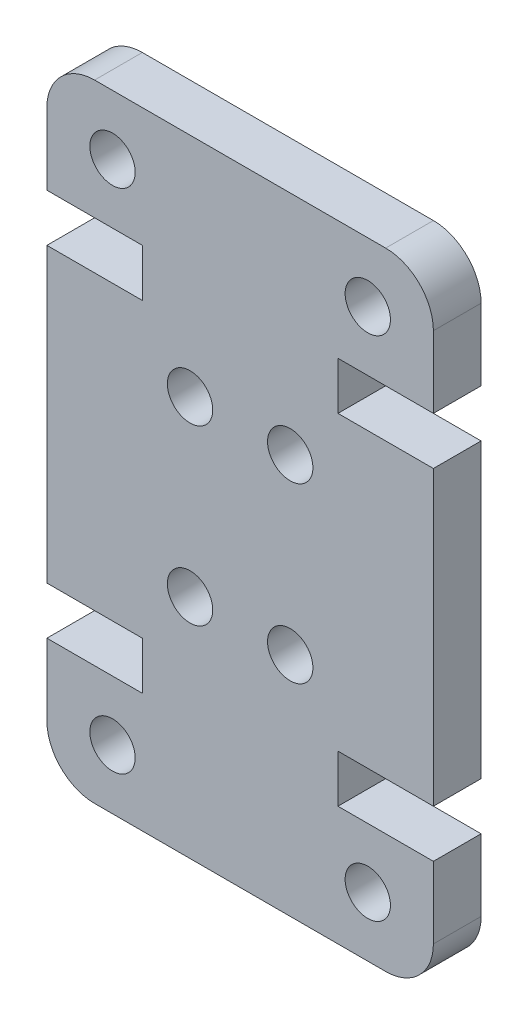
ISO-10303-21;
HEADER;
FILE_DESCRIPTION(('STEP AP214'),'2;1');
FILE_NAME('part.step','',(''),(''),'','','');
FILE_SCHEMA(('AUTOMOTIVE_DESIGN { 1 0 10303 214 1 1 1 1 }'));
ENDSEC;
DATA;
#1=APPLICATION_CONTEXT('core data for automotive mechanical design processes');
#2=APPLICATION_PROTOCOL_DEFINITION('international standard','automotive_design',2000,#1);
#3=PRODUCT_CONTEXT('',#1,'mechanical');
#4=PRODUCT('Part','Part','',(#3));
#5=PRODUCT_RELATED_PRODUCT_CATEGORY('part','',(#4));
#6=PRODUCT_DEFINITION_FORMATION('','',#4);
#7=PRODUCT_DEFINITION_CONTEXT('part definition',#1,'design');
#8=PRODUCT_DEFINITION('design','',#6,#7);
#9=PRODUCT_DEFINITION_SHAPE('','',#8);
#10=(LENGTH_UNIT() NAMED_UNIT(*) SI_UNIT(.MILLI.,.METRE.));
#11=(NAMED_UNIT(*) PLANE_ANGLE_UNIT() SI_UNIT($,.RADIAN.));
#12=(NAMED_UNIT(*) SI_UNIT($,.STERADIAN.) SOLID_ANGLE_UNIT());
#13=UNCERTAINTY_MEASURE_WITH_UNIT(LENGTH_MEASURE(1.E-05),#10,'distance_accuracy_value','');
#14=(GEOMETRIC_REPRESENTATION_CONTEXT(3) GLOBAL_UNCERTAINTY_ASSIGNED_CONTEXT((#13)) GLOBAL_UNIT_ASSIGNED_CONTEXT((#10,
#11,#12)) REPRESENTATION_CONTEXT('',''));
#15=CARTESIAN_POINT('',(0.,0.,0.));
#16=DIRECTION('',(0.,0.,1.));
#17=DIRECTION('',(1.,0.,0.));
#18=AXIS2_PLACEMENT_3D('',#15,#16,#17);
#19=CARTESIAN_POINT('',(14.2,2.,0.));
#20=DIRECTION('',(0.,0.,-1.));
#21=DIRECTION('',(-1.,0.,0.));
#22=AXIS2_PLACEMENT_3D('',#19,#20,#21);
#23=PLANE('',#22);
#24=CARTESIAN_POINT('',(6.00000000000001,9.49999999999963,0.));
#25=DIRECTION('',(0.,0.,1.));
#26=DIRECTION('',(1.,0.,0.));
#27=AXIS2_PLACEMENT_3D('',#24,#25,#26);
#28=CIRCLE('',#27,0.95);
#29=CARTESIAN_POINT('',(6.95,9.49999999999963,0.));
#30=VERTEX_POINT('',#29);
#31=EDGE_CURVE('E359',#30,#30,#28,.T.);
#32=ORIENTED_EDGE('',*,*,#31,.T.);
#33=EDGE_LOOP('',(#32));
#34=FACE_BOUND('',#33,.T.);
#35=CARTESIAN_POINT('',(10.2,16.7600000000004,0.));
#36=DIRECTION('',(0.,0.,1.));
#37=DIRECTION('',(1.,0.,0.));
#38=AXIS2_PLACEMENT_3D('',#35,#36,#37);
#39=CIRCLE('',#38,0.949999999999999);
#40=CARTESIAN_POINT('',(11.15,16.7600000000004,0.));
#41=VERTEX_POINT('',#40);
#42=EDGE_CURVE('E353',#41,#41,#39,.T.);
#43=ORIENTED_EDGE('',*,*,#42,.T.);
#44=EDGE_LOOP('',(#43));
#45=FACE_BOUND('',#44,.T.);
#46=CARTESIAN_POINT('',(2.75000000000002,23.7599999999998,0.));
#47=DIRECTION('',(0.,0.,1.));
#48=DIRECTION('',(-1.,0.,0.));
#49=AXIS2_PLACEMENT_3D('',#46,#47,#48);
#50=CIRCLE('',#49,0.95);
#51=CARTESIAN_POINT('',(1.80000000000003,23.7599999999998,0.));
#52=VERTEX_POINT('',#51);
#53=EDGE_CURVE('E347',#52,#52,#50,.T.);
#54=ORIENTED_EDGE('',*,*,#53,.T.);
#55=EDGE_LOOP('',(#54));
#56=FACE_BOUND('',#55,.T.);
#57=CARTESIAN_POINT('',(13.45,2.50000000000017,0.));
#58=DIRECTION('',(0.,0.,1.));
#59=DIRECTION('',(-1.,0.,0.));
#60=AXIS2_PLACEMENT_3D('',#57,#58,#59);
#61=CIRCLE('',#60,0.949999999999999);
#62=CARTESIAN_POINT('',(12.5,2.50000000000017,0.));
#63=VERTEX_POINT('',#62);
#64=EDGE_CURVE('E340',#63,#63,#61,.T.);
#65=ORIENTED_EDGE('',*,*,#64,.T.);
#66=EDGE_LOOP('',(#65));
#67=FACE_BOUND('',#66,.T.);
#68=CARTESIAN_POINT('',(14.2,2.,0.));
#69=DIRECTION('',(0.,0.,1.));
#70=DIRECTION('',(-1.,0.,0.));
#71=AXIS2_PLACEMENT_3D('',#68,#69,#70);
#72=CIRCLE('',#71,2.);
#73=CARTESIAN_POINT('',(14.2,0.,0.));
#74=VERTEX_POINT('',#73);
#75=CARTESIAN_POINT('',(16.2,2.,0.));
#76=VERTEX_POINT('',#75);
#77=EDGE_CURVE('E271',#74,#76,#72,.T.);
#78=ORIENTED_EDGE('',*,*,#77,.F.);
#79=DIRECTION('',(1.,0.,0.));
#80=VECTOR('',#79,1.);
#81=CARTESIAN_POINT('',(2.,0.,0.));
#82=LINE('',#81,#80);
#83=CARTESIAN_POINT('',(2.,0.,0.));
#84=VERTEX_POINT('',#83);
#85=EDGE_CURVE('E207',#84,#74,#82,.T.);
#86=ORIENTED_EDGE('',*,*,#85,.F.);
#87=CARTESIAN_POINT('',(2.,2.,0.));
#88=DIRECTION('',(0.,0.,1.));
#89=DIRECTION('',(1.,0.,0.));
#90=AXIS2_PLACEMENT_3D('',#87,#88,#89);
#91=CIRCLE('',#90,2.);
#92=CARTESIAN_POINT('',(0.,2.,0.));
#93=VERTEX_POINT('',#92);
#94=EDGE_CURVE('E213',#93,#84,#91,.T.);
#95=ORIENTED_EDGE('',*,*,#94,.F.);
#96=DIRECTION('',(0.,-1.,0.));
#97=VECTOR('',#96,1.);
#98=CARTESIAN_POINT('',(0.,2.,0.));
#99=LINE('',#98,#97);
#100=CARTESIAN_POINT('',(0.,4.99999999999945,0.));
#101=VERTEX_POINT('',#100);
#102=EDGE_CURVE('E332',#101,#93,#99,.T.);
#103=ORIENTED_EDGE('',*,*,#102,.F.);
#104=DIRECTION('',(-1.,0.,0.));
#105=VECTOR('',#104,1.);
#106=CARTESIAN_POINT('',(4.,4.99999999999945,0.));
#107=LINE('',#106,#105);
#108=CARTESIAN_POINT('',(4.,4.99999999999945,0.));
#109=VERTEX_POINT('',#108);
#110=EDGE_CURVE('E329',#109,#101,#107,.T.);
#111=ORIENTED_EDGE('',*,*,#110,.F.);
#112=DIRECTION('',(0.,-1.,0.));
#113=VECTOR('',#112,1.);
#114=CARTESIAN_POINT('',(4.,6.99999999999945,0.));
#115=LINE('',#114,#113);
#116=CARTESIAN_POINT('',(4.,6.99999999999945,0.));
#117=VERTEX_POINT('',#116);
#118=EDGE_CURVE('E326',#117,#109,#115,.T.);
#119=ORIENTED_EDGE('',*,*,#118,.F.);
#120=DIRECTION('',(1.,0.,0.));
#121=VECTOR('',#120,1.);
#122=CARTESIAN_POINT('',(0.,6.99999999999945,0.));
#123=LINE('',#122,#121);
#124=CARTESIAN_POINT('',(0.,6.99999999999945,0.));
#125=VERTEX_POINT('',#124);
#126=EDGE_CURVE('E323',#125,#117,#123,.T.);
#127=ORIENTED_EDGE('',*,*,#126,.F.);
#128=DIRECTION('',(0.,-1.,0.));
#129=VECTOR('',#128,1.);
#130=CARTESIAN_POINT('',(0.,6.99999999999945,0.));
#131=LINE('',#130,#129);
#132=CARTESIAN_POINT('',(0.,19.2600000000005,0.));
#133=VERTEX_POINT('',#132);
#134=EDGE_CURVE('E320',#133,#125,#131,.T.);
#135=ORIENTED_EDGE('',*,*,#134,.F.);
#136=DIRECTION('',(-1.,0.,0.));
#137=VECTOR('',#136,1.);
#138=CARTESIAN_POINT('',(0.,19.2600000000005,0.));
#139=LINE('',#138,#137);
#140=CARTESIAN_POINT('',(4.,19.2600000000005,0.));
#141=VERTEX_POINT('',#140);
#142=EDGE_CURVE('E317',#141,#133,#139,.T.);
#143=ORIENTED_EDGE('',*,*,#142,.F.);
#144=DIRECTION('',(0.,-1.,0.));
#145=VECTOR('',#144,1.);
#146=CARTESIAN_POINT('',(4.,19.2600000000005,0.));
#147=LINE('',#146,#145);
#148=CARTESIAN_POINT('',(3.99999999999999,21.2600000000005,0.));
#149=VERTEX_POINT('',#148);
#150=EDGE_CURVE('E314',#149,#141,#147,.T.);
#151=ORIENTED_EDGE('',*,*,#150,.F.);
#152=DIRECTION('',(1.,0.,0.));
#153=VECTOR('',#152,1.);
#154=CARTESIAN_POINT('',(3.99999999999999,21.2600000000005,0.));
#155=LINE('',#154,#153);
#156=CARTESIAN_POINT('',(0.,21.2600000000005,0.));
#157=VERTEX_POINT('',#156);
#158=EDGE_CURVE('E311',#157,#149,#155,.T.);
#159=ORIENTED_EDGE('',*,*,#158,.F.);
#160=DIRECTION('',(0.,-1.,0.));
#161=VECTOR('',#160,1.);
#162=CARTESIAN_POINT('',(0.,24.26,0.));
#163=LINE('',#162,#161);
#164=CARTESIAN_POINT('',(0.,24.26,0.));
#165=VERTEX_POINT('',#164);
#166=EDGE_CURVE('E308',#165,#157,#163,.T.);
#167=ORIENTED_EDGE('',*,*,#166,.F.);
#168=CARTESIAN_POINT('',(2.,24.26,0.));
#169=DIRECTION('',(0.,0.,1.));
#170=DIRECTION('',(-1.,0.,0.));
#171=AXIS2_PLACEMENT_3D('',#168,#169,#170);
#172=CIRCLE('',#171,2.);
#173=CARTESIAN_POINT('',(1.99999999999999,26.26,0.));
#174=VERTEX_POINT('',#173);
#175=EDGE_CURVE('E305',#174,#165,#172,.T.);
#176=ORIENTED_EDGE('',*,*,#175,.F.);
#177=DIRECTION('',(-1.,0.,0.));
#178=VECTOR('',#177,1.);
#179=CARTESIAN_POINT('',(1.99999999999999,26.26,0.));
#180=LINE('',#179,#178);
#181=CARTESIAN_POINT('',(14.2,26.26,0.));
#182=VERTEX_POINT('',#181);
#183=EDGE_CURVE('E302',#182,#174,#180,.T.);
#184=ORIENTED_EDGE('',*,*,#183,.F.);
#185=CARTESIAN_POINT('',(14.2,24.26,0.));
#186=DIRECTION('',(0.,0.,1.));
#187=DIRECTION('',(1.,0.,0.));
#188=AXIS2_PLACEMENT_3D('',#185,#186,#187);
#189=CIRCLE('',#188,2.);
#190=CARTESIAN_POINT('',(16.2,24.26,0.));
#191=VERTEX_POINT('',#190);
#192=EDGE_CURVE('E299',#191,#182,#189,.T.);
#193=ORIENTED_EDGE('',*,*,#192,.F.);
#194=DIRECTION('',(0.,1.,0.));
#195=VECTOR('',#194,1.);
#196=CARTESIAN_POINT('',(16.2,24.26,0.));
#197=LINE('',#196,#195);
#198=CARTESIAN_POINT('',(16.2,21.2600000000005,0.));
#199=VERTEX_POINT('',#198);
#200=EDGE_CURVE('E296',#199,#191,#197,.T.);
#201=ORIENTED_EDGE('',*,*,#200,.F.);
#202=DIRECTION('',(1.,0.,0.));
#203=VECTOR('',#202,1.);
#204=CARTESIAN_POINT('',(12.2,21.2600000000005,0.));
#205=LINE('',#204,#203);
#206=CARTESIAN_POINT('',(12.2,21.2600000000005,0.));
#207=VERTEX_POINT('',#206);
#208=EDGE_CURVE('E293',#207,#199,#205,.T.);
#209=ORIENTED_EDGE('',*,*,#208,.F.);
#210=DIRECTION('',(0.,1.,0.));
#211=VECTOR('',#210,1.);
#212=CARTESIAN_POINT('',(12.2,19.2600000000005,0.));
#213=LINE('',#212,#211);
#214=CARTESIAN_POINT('',(12.2,19.2600000000005,0.));
#215=VERTEX_POINT('',#214);
#216=EDGE_CURVE('E290',#215,#207,#213,.T.);
#217=ORIENTED_EDGE('',*,*,#216,.F.);
#218=DIRECTION('',(-1.,0.,0.));
#219=VECTOR('',#218,1.);
#220=CARTESIAN_POINT('',(16.2,19.2600000000005,0.));
#221=LINE('',#220,#219);
#222=CARTESIAN_POINT('',(16.2,19.2600000000005,0.));
#223=VERTEX_POINT('',#222);
#224=EDGE_CURVE('E287',#223,#215,#221,.T.);
#225=ORIENTED_EDGE('',*,*,#224,.F.);
#226=DIRECTION('',(0.,1.,0.));
#227=VECTOR('',#226,1.);
#228=CARTESIAN_POINT('',(16.2,6.99999999999945,0.));
#229=LINE('',#228,#227);
#230=CARTESIAN_POINT('',(16.2,6.99999999999945,0.));
#231=VERTEX_POINT('',#230);
#232=EDGE_CURVE('E284',#231,#223,#229,.T.);
#233=ORIENTED_EDGE('',*,*,#232,.F.);
#234=DIRECTION('',(1.,0.,0.));
#235=VECTOR('',#234,1.);
#236=CARTESIAN_POINT('',(16.2,6.99999999999945,0.));
#237=LINE('',#236,#235);
#238=CARTESIAN_POINT('',(12.2,6.99999999999945,0.));
#239=VERTEX_POINT('',#238);
#240=EDGE_CURVE('E278',#239,#231,#237,.T.);
#241=ORIENTED_EDGE('',*,*,#240,.F.);
#242=DIRECTION('',(0.,1.,0.));
#243=VECTOR('',#242,1.);
#244=CARTESIAN_POINT('',(12.2,6.99999999999945,0.));
#245=LINE('',#244,#243);
#246=CARTESIAN_POINT('',(12.2,4.99999999999945,0.));
#247=VERTEX_POINT('',#246);
#248=EDGE_CURVE('E276',#247,#239,#245,.T.);
#249=ORIENTED_EDGE('',*,*,#248,.F.);
#250=DIRECTION('',(-1.,0.,0.));
#251=VECTOR('',#250,1.);
#252=CARTESIAN_POINT('',(12.2,4.99999999999945,0.));
#253=LINE('',#252,#251);
#254=CARTESIAN_POINT('',(16.2,4.99999999999945,0.));
#255=VERTEX_POINT('',#254);
#256=EDGE_CURVE('E264',#255,#247,#253,.T.);
#257=ORIENTED_EDGE('',*,*,#256,.F.);
#258=DIRECTION('',(0.,1.,0.));
#259=VECTOR('',#258,1.);
#260=CARTESIAN_POINT('',(16.2,2.,0.));
#261=LINE('',#260,#259);
#262=EDGE_CURVE('E268',#76,#255,#261,.T.);
#263=ORIENTED_EDGE('',*,*,#262,.F.);
#264=EDGE_LOOP('',(#78,#86,#95,#103,#111,#119,#127,#135,#143,#151,#159,#167,#176,#184,#193,#201,
#209,#217,#225,#233,#241,#249,#257,#263));
#265=FACE_BOUND('',#264,.T.);
#266=CARTESIAN_POINT('',(10.2,9.49999999999963,0.));
#267=DIRECTION('',(0.,0.,1.));
#268=DIRECTION('',(-1.,0.,0.));
#269=AXIS2_PLACEMENT_3D('',#266,#267,#268);
#270=CIRCLE('',#269,0.949999999999999);
#271=CARTESIAN_POINT('',(9.24999999999999,9.49999999999963,0.));
#272=VERTEX_POINT('',#271);
#273=EDGE_CURVE('E342',#272,#272,#270,.T.);
#274=ORIENTED_EDGE('',*,*,#273,.T.);
#275=EDGE_LOOP('',(#274));
#276=FACE_BOUND('',#275,.T.);
#277=CARTESIAN_POINT('',(6.,16.7600000000004,0.));
#278=DIRECTION('',(0.,0.,1.));
#279=DIRECTION('',(-1.,0.,0.));
#280=AXIS2_PLACEMENT_3D('',#277,#278,#279);
#281=CIRCLE('',#280,0.949999999999999);
#282=CARTESIAN_POINT('',(5.05,16.7600000000004,0.));
#283=VERTEX_POINT('',#282);
#284=EDGE_CURVE('E350',#283,#283,#281,.T.);
#285=ORIENTED_EDGE('',*,*,#284,.T.);
#286=EDGE_LOOP('',(#285));
#287=FACE_BOUND('',#286,.T.);
#288=CARTESIAN_POINT('',(13.45,23.7599999999998,0.));
#289=DIRECTION('',(0.,0.,1.));
#290=DIRECTION('',(1.,0.,0.));
#291=AXIS2_PLACEMENT_3D('',#288,#289,#290);
#292=CIRCLE('',#291,0.949999999999999);
#293=CARTESIAN_POINT('',(14.4,23.7599999999998,0.));
#294=VERTEX_POINT('',#293);
#295=EDGE_CURVE('E356',#294,#294,#292,.T.);
#296=ORIENTED_EDGE('',*,*,#295,.T.);
#297=EDGE_LOOP('',(#296));
#298=FACE_BOUND('',#297,.T.);
#299=CARTESIAN_POINT('',(2.75000000000003,2.50000000000017,0.));
#300=DIRECTION('',(0.,0.,1.));
#301=DIRECTION('',(1.,0.,0.));
#302=AXIS2_PLACEMENT_3D('',#299,#300,#301);
#303=CIRCLE('',#302,0.95);
#304=CARTESIAN_POINT('',(3.70000000000003,2.50000000000017,0.));
#305=VERTEX_POINT('',#304);
#306=EDGE_CURVE('E202',#305,#305,#303,.T.);
#307=ORIENTED_EDGE('',*,*,#306,.T.);
#308=EDGE_LOOP('',(#307));
#309=FACE_BOUND('',#308,.T.);
#310=ADVANCED_FACE('F33',(#34,#45,#56,#67,#265,#276,#287,#298,#309),#23,.T.);
#311=CARTESIAN_POINT('',(14.2,2.,4.));
#312=DIRECTION('',(0.,0.,-1.));
#313=DIRECTION('',(-1.,0.,0.));
#314=AXIS2_PLACEMENT_3D('',#311,#312,#313);
#315=CYLINDRICAL_SURFACE('',#314,2.);
#316=DIRECTION('',(0.,0.,-1.));
#317=VECTOR('',#316,1.);
#318=CARTESIAN_POINT('',(16.2,2.,4.));
#319=LINE('',#318,#317);
#320=CARTESIAN_POINT('',(16.2,2.00000000000001,2.));
#321=VERTEX_POINT('',#320);
#322=EDGE_CURVE('E11',#321,#76,#319,.T.);
#323=ORIENTED_EDGE('',*,*,#322,.F.);
#324=CARTESIAN_POINT('',(14.2,2.,2.));
#325=DIRECTION('',(0.,0.,-1.));
#326=DIRECTION('',(-1.,0.,0.));
#327=AXIS2_PLACEMENT_3D('',#324,#325,#326);
#328=CIRCLE('',#327,2.);
#329=CARTESIAN_POINT('',(14.2,0.,2.));
#330=VERTEX_POINT('',#329);
#331=EDGE_CURVE('E195',#321,#330,#328,.T.);
#332=ORIENTED_EDGE('',*,*,#331,.T.);
#333=DIRECTION('',(0.,0.,-1.));
#334=VECTOR('',#333,1.);
#335=CARTESIAN_POINT('',(14.2,0.,4.));
#336=LINE('',#335,#334);
#337=EDGE_CURVE('E57',#330,#74,#336,.T.);
#338=ORIENTED_EDGE('',*,*,#337,.T.);
#339=ORIENTED_EDGE('',*,*,#77,.T.);
#340=EDGE_LOOP('',(#323,#332,#338,#339));
#341=FACE_BOUND('',#340,.T.);
#342=ADVANCED_FACE('F35',(#341),#315,.T.);
#343=CARTESIAN_POINT('',(16.2,2.,4.));
#344=DIRECTION('',(-1.,0.,0.));
#345=DIRECTION('',(0.,0.,1.));
#346=AXIS2_PLACEMENT_3D('',#343,#344,#345);
#347=PLANE('',#346);
#348=DIRECTION('',(0.,0.,-1.));
#349=VECTOR('',#348,1.);
#350=CARTESIAN_POINT('',(16.2,4.99999999999945,4.));
#351=LINE('',#350,#349);
#352=CARTESIAN_POINT('',(16.2,4.99999999999945,2.));
#353=VERTEX_POINT('',#352);
#354=EDGE_CURVE('E42',#353,#255,#351,.T.);
#355=ORIENTED_EDGE('',*,*,#354,.F.);
#356=DIRECTION('',(0.,1.,0.));
#357=VECTOR('',#356,1.);
#358=CARTESIAN_POINT('',(16.2,26.26,2.));
#359=LINE('',#358,#357);
#360=EDGE_CURVE('E432',#321,#353,#359,.T.);
#361=ORIENTED_EDGE('',*,*,#360,.F.);
#362=ORIENTED_EDGE('',*,*,#322,.T.);
#363=ORIENTED_EDGE('',*,*,#262,.T.);
#364=EDGE_LOOP('',(#355,#361,#362,#363));
#365=FACE_BOUND('',#364,.T.);
#366=ADVANCED_FACE('F269',(#365),#347,.F.);
#367=CARTESIAN_POINT('',(12.2,4.99999999999945,4.));
#368=DIRECTION('',(0.,-1.,0.));
#369=DIRECTION('',(0.,0.,-1.));
#370=AXIS2_PLACEMENT_3D('',#367,#368,#369);
#371=PLANE('',#370);
#372=DIRECTION('',(0.,0.,-1.));
#373=VECTOR('',#372,1.);
#374=CARTESIAN_POINT('',(12.2,4.99999999999945,4.));
#375=LINE('',#374,#373);
#376=CARTESIAN_POINT('',(12.2,4.99999999999945,2.));
#377=VERTEX_POINT('',#376);
#378=EDGE_CURVE('E254',#377,#247,#375,.T.);
#379=ORIENTED_EDGE('',*,*,#378,.F.);
#380=DIRECTION('',(1.,0.,0.));
#381=VECTOR('',#380,1.);
#382=CARTESIAN_POINT('',(12.2,4.99999999999945,2.));
#383=LINE('',#382,#381);
#384=EDGE_CURVE('E203',#377,#353,#383,.T.);
#385=ORIENTED_EDGE('',*,*,#384,.T.);
#386=ORIENTED_EDGE('',*,*,#354,.T.);
#387=ORIENTED_EDGE('',*,*,#256,.T.);
#388=EDGE_LOOP('',(#379,#385,#386,#387));
#389=FACE_BOUND('',#388,.T.);
#390=ADVANCED_FACE('F262',(#389),#371,.F.);
#391=CARTESIAN_POINT('',(12.2,6.99999999999945,4.));
#392=DIRECTION('',(-1.,0.,0.));
#393=DIRECTION('',(0.,-1.,0.));
#394=AXIS2_PLACEMENT_3D('',#391,#392,#393);
#395=PLANE('',#394);
#396=DIRECTION('',(0.,0.,-1.));
#397=VECTOR('',#396,1.);
#398=CARTESIAN_POINT('',(12.2,6.99999999999945,4.));
#399=LINE('',#398,#397);
#400=CARTESIAN_POINT('',(12.2,6.99999999999945,2.));
#401=VERTEX_POINT('',#400);
#402=EDGE_CURVE('E252',#401,#239,#399,.T.);
#403=ORIENTED_EDGE('',*,*,#402,.F.);
#404=DIRECTION('',(0.,-1.,0.));
#405=VECTOR('',#404,1.);
#406=CARTESIAN_POINT('',(12.2,6.99999999999945,2.));
#407=LINE('',#406,#405);
#408=EDGE_CURVE('E365',#401,#377,#407,.T.);
#409=ORIENTED_EDGE('',*,*,#408,.T.);
#410=ORIENTED_EDGE('',*,*,#378,.T.);
#411=ORIENTED_EDGE('',*,*,#248,.T.);
#412=EDGE_LOOP('',(#403,#409,#410,#411));
#413=FACE_BOUND('',#412,.T.);
#414=ADVANCED_FACE('F437',(#413),#395,.F.);
#415=CARTESIAN_POINT('',(16.2,6.99999999999945,4.));
#416=DIRECTION('',(0.,1.,0.));
#417=DIRECTION('',(-1.,0.,0.));
#418=AXIS2_PLACEMENT_3D('',#415,#416,#417);
#419=PLANE('',#418);
#420=DIRECTION('',(0.,0.,-1.));
#421=VECTOR('',#420,1.);
#422=CARTESIAN_POINT('',(16.2,6.99999999999945,4.));
#423=LINE('',#422,#421);
#424=CARTESIAN_POINT('',(16.2,6.99999999999945,2.));
#425=VERTEX_POINT('',#424);
#426=EDGE_CURVE('E250',#425,#231,#423,.T.);
#427=ORIENTED_EDGE('',*,*,#426,.F.);
#428=DIRECTION('',(-1.,0.,0.));
#429=VECTOR('',#428,1.);
#430=CARTESIAN_POINT('',(16.2,6.99999999999945,2.));
#431=LINE('',#430,#429);
#432=EDGE_CURVE('E368',#425,#401,#431,.T.);
#433=ORIENTED_EDGE('',*,*,#432,.T.);
#434=ORIENTED_EDGE('',*,*,#402,.T.);
#435=ORIENTED_EDGE('',*,*,#240,.T.);
#436=EDGE_LOOP('',(#427,#433,#434,#435));
#437=FACE_BOUND('',#436,.T.);
#438=ADVANCED_FACE('F440',(#437),#419,.F.);
#439=CARTESIAN_POINT('',(16.2,6.99999999999945,4.));
#440=DIRECTION('',(-1.,0.,0.));
#441=DIRECTION('',(0.,0.,1.));
#442=AXIS2_PLACEMENT_3D('',#439,#440,#441);
#443=PLANE('',#442);
#444=DIRECTION('',(0.,0.,-1.));
#445=VECTOR('',#444,1.);
#446=CARTESIAN_POINT('',(16.2,19.2600000000005,4.));
#447=LINE('',#446,#445);
#448=CARTESIAN_POINT('',(16.2,19.2600000000005,2.));
#449=VERTEX_POINT('',#448);
#450=EDGE_CURVE('E248',#449,#223,#447,.T.);
#451=ORIENTED_EDGE('',*,*,#450,.F.);
#452=EDGE_CURVE('E433',#425,#449,#359,.T.);
#453=ORIENTED_EDGE('',*,*,#452,.F.);
#454=ORIENTED_EDGE('',*,*,#426,.T.);
#455=ORIENTED_EDGE('',*,*,#232,.T.);
#456=EDGE_LOOP('',(#451,#453,#454,#455));
#457=FACE_BOUND('',#456,.T.);
#458=ADVANCED_FACE('F445',(#457),#443,.F.);
#459=CARTESIAN_POINT('',(16.2,19.2600000000005,4.));
#460=DIRECTION('',(0.,-1.,0.));
#461=DIRECTION('',(0.,0.,-1.));
#462=AXIS2_PLACEMENT_3D('',#459,#460,#461);
#463=PLANE('',#462);
#464=DIRECTION('',(0.,0.,-1.));
#465=VECTOR('',#464,1.);
#466=CARTESIAN_POINT('',(12.2,19.2600000000005,4.));
#467=LINE('',#466,#465);
#468=CARTESIAN_POINT('',(12.2,19.2600000000005,2.));
#469=VERTEX_POINT('',#468);
#470=EDGE_CURVE('E246',#469,#215,#467,.T.);
#471=ORIENTED_EDGE('',*,*,#470,.F.);
#472=DIRECTION('',(1.,0.,0.));
#473=VECTOR('',#472,1.);
#474=CARTESIAN_POINT('',(16.2,19.2600000000005,2.));
#475=LINE('',#474,#473);
#476=EDGE_CURVE('E371',#469,#449,#475,.T.);
#477=ORIENTED_EDGE('',*,*,#476,.T.);
#478=ORIENTED_EDGE('',*,*,#450,.T.);
#479=ORIENTED_EDGE('',*,*,#224,.T.);
#480=EDGE_LOOP('',(#471,#477,#478,#479));
#481=FACE_BOUND('',#480,.T.);
#482=ADVANCED_FACE('F449',(#481),#463,.F.);
#483=CARTESIAN_POINT('',(12.2,19.2600000000005,4.));
#484=DIRECTION('',(-1.,0.,0.));
#485=DIRECTION('',(0.,-1.,0.));
#486=AXIS2_PLACEMENT_3D('',#483,#484,#485);
#487=PLANE('',#486);
#488=DIRECTION('',(0.,0.,-1.));
#489=VECTOR('',#488,1.);
#490=CARTESIAN_POINT('',(12.2,21.2600000000005,4.));
#491=LINE('',#490,#489);
#492=CARTESIAN_POINT('',(12.2,21.2600000000005,2.));
#493=VERTEX_POINT('',#492);
#494=EDGE_CURVE('E244',#493,#207,#491,.T.);
#495=ORIENTED_EDGE('',*,*,#494,.F.);
#496=DIRECTION('',(0.,-1.,0.));
#497=VECTOR('',#496,1.);
#498=CARTESIAN_POINT('',(12.2,19.2600000000005,2.));
#499=LINE('',#498,#497);
#500=EDGE_CURVE('E374',#493,#469,#499,.T.);
#501=ORIENTED_EDGE('',*,*,#500,.T.);
#502=ORIENTED_EDGE('',*,*,#470,.T.);
#503=ORIENTED_EDGE('',*,*,#216,.T.);
#504=EDGE_LOOP('',(#495,#501,#502,#503));
#505=FACE_BOUND('',#504,.T.);
#506=ADVANCED_FACE('F453',(#505),#487,.F.);
#507=CARTESIAN_POINT('',(12.2,21.2600000000005,4.));
#508=DIRECTION('',(0.,1.,0.));
#509=DIRECTION('',(0.,0.,1.));
#510=AXIS2_PLACEMENT_3D('',#507,#508,#509);
#511=PLANE('',#510);
#512=DIRECTION('',(0.,0.,-1.));
#513=VECTOR('',#512,1.);
#514=CARTESIAN_POINT('',(16.2,21.2600000000005,4.));
#515=LINE('',#514,#513);
#516=CARTESIAN_POINT('',(16.2,21.2600000000005,2.));
#517=VERTEX_POINT('',#516);
#518=EDGE_CURVE('E242',#517,#199,#515,.T.);
#519=ORIENTED_EDGE('',*,*,#518,.F.);
#520=DIRECTION('',(-1.,0.,0.));
#521=VECTOR('',#520,1.);
#522=CARTESIAN_POINT('',(12.2,21.2600000000005,2.));
#523=LINE('',#522,#521);
#524=EDGE_CURVE('E377',#517,#493,#523,.T.);
#525=ORIENTED_EDGE('',*,*,#524,.T.);
#526=ORIENTED_EDGE('',*,*,#494,.T.);
#527=ORIENTED_EDGE('',*,*,#208,.T.);
#528=EDGE_LOOP('',(#519,#525,#526,#527));
#529=FACE_BOUND('',#528,.T.);
#530=ADVANCED_FACE('F457',(#529),#511,.F.);
#531=CARTESIAN_POINT('',(16.2,24.26,4.));
#532=DIRECTION('',(-1.,0.,0.));
#533=DIRECTION('',(0.,0.,1.));
#534=AXIS2_PLACEMENT_3D('',#531,#532,#533);
#535=PLANE('',#534);
#536=DIRECTION('',(0.,0.,-1.));
#537=VECTOR('',#536,1.);
#538=CARTESIAN_POINT('',(16.2,24.26,4.));
#539=LINE('',#538,#537);
#540=CARTESIAN_POINT('',(16.2,24.26,2.));
#541=VERTEX_POINT('',#540);
#542=EDGE_CURVE('E240',#541,#191,#539,.T.);
#543=ORIENTED_EDGE('',*,*,#542,.F.);
#544=EDGE_CURVE('E199',#517,#541,#359,.T.);
#545=ORIENTED_EDGE('',*,*,#544,.F.);
#546=ORIENTED_EDGE('',*,*,#518,.T.);
#547=ORIENTED_EDGE('',*,*,#200,.T.);
#548=EDGE_LOOP('',(#543,#545,#546,#547));
#549=FACE_BOUND('',#548,.T.);
#550=ADVANCED_FACE('F461',(#549),#535,.F.);
#551=CARTESIAN_POINT('',(14.2,24.26,4.));
#552=DIRECTION('',(0.,0.,-1.));
#553=DIRECTION('',(-1.,0.,0.));
#554=AXIS2_PLACEMENT_3D('',#551,#552,#553);
#555=CYLINDRICAL_SURFACE('',#554,2.);
#556=DIRECTION('',(0.,0.,-1.));
#557=VECTOR('',#556,1.);
#558=CARTESIAN_POINT('',(14.2,26.26,4.));
#559=LINE('',#558,#557);
#560=CARTESIAN_POINT('',(14.2,26.26,2.));
#561=VERTEX_POINT('',#560);
#562=EDGE_CURVE('E238',#561,#182,#559,.T.);
#563=ORIENTED_EDGE('',*,*,#562,.F.);
#564=CARTESIAN_POINT('',(14.2,24.26,2.));
#565=DIRECTION('',(0.,0.,-1.));
#566=DIRECTION('',(-1.,0.,0.));
#567=AXIS2_PLACEMENT_3D('',#564,#565,#566);
#568=CIRCLE('',#567,2.);
#569=EDGE_CURVE('E380',#561,#541,#568,.T.);
#570=ORIENTED_EDGE('',*,*,#569,.T.);
#571=ORIENTED_EDGE('',*,*,#542,.T.);
#572=ORIENTED_EDGE('',*,*,#192,.T.);
#573=EDGE_LOOP('',(#563,#570,#571,#572));
#574=FACE_BOUND('',#573,.T.);
#575=ADVANCED_FACE('F465',(#574),#555,.T.);
#576=CARTESIAN_POINT('',(1.99999999999999,26.26,4.));
#577=DIRECTION('',(0.,-1.,0.));
#578=DIRECTION('',(0.,0.,-1.));
#579=AXIS2_PLACEMENT_3D('',#576,#577,#578);
#580=PLANE('',#579);
#581=DIRECTION('',(0.,0.,-1.));
#582=VECTOR('',#581,1.);
#583=CARTESIAN_POINT('',(1.99999999999999,26.26,4.));
#584=LINE('',#583,#582);
#585=CARTESIAN_POINT('',(2.,26.26,2.));
#586=VERTEX_POINT('',#585);
#587=EDGE_CURVE('E236',#586,#174,#584,.T.);
#588=ORIENTED_EDGE('',*,*,#587,.F.);
#589=DIRECTION('',(-1.,0.,0.));
#590=VECTOR('',#589,1.);
#591=CARTESIAN_POINT('',(0.,26.26,2.));
#592=LINE('',#591,#590);
#593=EDGE_CURVE('E429',#561,#586,#592,.T.);
#594=ORIENTED_EDGE('',*,*,#593,.F.);
#595=ORIENTED_EDGE('',*,*,#562,.T.);
#596=ORIENTED_EDGE('',*,*,#183,.T.);
#597=EDGE_LOOP('',(#588,#594,#595,#596));
#598=FACE_BOUND('',#597,.T.);
#599=ADVANCED_FACE('F470',(#598),#580,.F.);
#600=CARTESIAN_POINT('',(2.,24.26,4.));
#601=DIRECTION('',(0.,0.,-1.));
#602=DIRECTION('',(-1.,0.,0.));
#603=AXIS2_PLACEMENT_3D('',#600,#601,#602);
#604=CYLINDRICAL_SURFACE('',#603,2.);
#605=DIRECTION('',(0.,0.,-1.));
#606=VECTOR('',#605,1.);
#607=CARTESIAN_POINT('',(0.,24.26,4.));
#608=LINE('',#607,#606);
#609=CARTESIAN_POINT('',(0.,24.26,2.));
#610=VERTEX_POINT('',#609);
#611=EDGE_CURVE('E234',#610,#165,#608,.T.);
#612=ORIENTED_EDGE('',*,*,#611,.F.);
#613=CARTESIAN_POINT('',(2.,24.26,2.));
#614=DIRECTION('',(0.,0.,-1.));
#615=DIRECTION('',(-1.,0.,0.));
#616=AXIS2_PLACEMENT_3D('',#613,#614,#615);
#617=CIRCLE('',#616,2.);
#618=EDGE_CURVE('E383',#610,#586,#617,.T.);
#619=ORIENTED_EDGE('',*,*,#618,.T.);
#620=ORIENTED_EDGE('',*,*,#587,.T.);
#621=ORIENTED_EDGE('',*,*,#175,.T.);
#622=EDGE_LOOP('',(#612,#619,#620,#621));
#623=FACE_BOUND('',#622,.T.);
#624=ADVANCED_FACE('F474',(#623),#604,.T.);
#625=CARTESIAN_POINT('',(0.,24.26,4.));
#626=DIRECTION('',(1.,0.,0.));
#627=DIRECTION('',(0.,1.,0.));
#628=AXIS2_PLACEMENT_3D('',#625,#626,#627);
#629=PLANE('',#628);
#630=DIRECTION('',(0.,0.,-1.));
#631=VECTOR('',#630,1.);
#632=CARTESIAN_POINT('',(0.,21.2600000000005,4.));
#633=LINE('',#632,#631);
#634=CARTESIAN_POINT('',(0.,21.2600000000005,2.));
#635=VERTEX_POINT('',#634);
#636=EDGE_CURVE('E232',#635,#157,#633,.T.);
#637=ORIENTED_EDGE('',*,*,#636,.F.);
#638=DIRECTION('',(0.,-1.,0.));
#639=VECTOR('',#638,1.);
#640=CARTESIAN_POINT('',(0.,0.,2.));
#641=LINE('',#640,#639);
#642=EDGE_CURVE('E430',#610,#635,#641,.T.);
#643=ORIENTED_EDGE('',*,*,#642,.F.);
#644=ORIENTED_EDGE('',*,*,#611,.T.);
#645=ORIENTED_EDGE('',*,*,#166,.T.);
#646=EDGE_LOOP('',(#637,#643,#644,#645));
#647=FACE_BOUND('',#646,.T.);
#648=ADVANCED_FACE('F479',(#647),#629,.F.);
#649=CARTESIAN_POINT('',(3.99999999999999,21.2600000000005,4.));
#650=DIRECTION('',(0.,1.,0.));
#651=DIRECTION('',(-1.,0.,0.));
#652=AXIS2_PLACEMENT_3D('',#649,#650,#651);
#653=PLANE('',#652);
#654=DIRECTION('',(0.,0.,-1.));
#655=VECTOR('',#654,1.);
#656=CARTESIAN_POINT('',(3.99999999999999,21.2600000000005,4.));
#657=LINE('',#656,#655);
#658=CARTESIAN_POINT('',(3.99999999999999,21.2600000000005,2.));
#659=VERTEX_POINT('',#658);
#660=EDGE_CURVE('E230',#659,#149,#657,.T.);
#661=ORIENTED_EDGE('',*,*,#660,.F.);
#662=DIRECTION('',(-1.,0.,0.));
#663=VECTOR('',#662,1.);
#664=CARTESIAN_POINT('',(3.99999999999999,21.2600000000005,2.));
#665=LINE('',#664,#663);
#666=EDGE_CURVE('E386',#659,#635,#665,.T.);
#667=ORIENTED_EDGE('',*,*,#666,.T.);
#668=ORIENTED_EDGE('',*,*,#636,.T.);
#669=ORIENTED_EDGE('',*,*,#158,.T.);
#670=EDGE_LOOP('',(#661,#667,#668,#669));
#671=FACE_BOUND('',#670,.T.);
#672=ADVANCED_FACE('F690',(#671),#653,.F.);
#673=CARTESIAN_POINT('',(4.,19.2600000000005,4.));
#674=DIRECTION('',(1.,0.,0.));
#675=DIRECTION('',(0.,1.,0.));
#676=AXIS2_PLACEMENT_3D('',#673,#674,#675);
#677=PLANE('',#676);
#678=DIRECTION('',(0.,0.,-1.));
#679=VECTOR('',#678,1.);
#680=CARTESIAN_POINT('',(4.,19.2600000000005,4.));
#681=LINE('',#680,#679);
#682=CARTESIAN_POINT('',(4.,19.2600000000005,2.));
#683=VERTEX_POINT('',#682);
#684=EDGE_CURVE('E228',#683,#141,#681,.T.);
#685=ORIENTED_EDGE('',*,*,#684,.F.);
#686=DIRECTION('',(0.,1.,0.));
#687=VECTOR('',#686,1.);
#688=CARTESIAN_POINT('',(4.,19.2600000000005,2.));
#689=LINE('',#688,#687);
#690=EDGE_CURVE('E389',#683,#659,#689,.T.);
#691=ORIENTED_EDGE('',*,*,#690,.T.);
#692=ORIENTED_EDGE('',*,*,#660,.T.);
#693=ORIENTED_EDGE('',*,*,#150,.T.);
#694=EDGE_LOOP('',(#685,#691,#692,#693));
#695=FACE_BOUND('',#694,.T.);
#696=ADVANCED_FACE('F681',(#695),#677,.F.);
#697=CARTESIAN_POINT('',(0.,19.2600000000005,4.));
#698=DIRECTION('',(0.,-1.,0.));
#699=DIRECTION('',(1.,0.,0.));
#700=AXIS2_PLACEMENT_3D('',#697,#698,#699);
#701=PLANE('',#700);
#702=DIRECTION('',(0.,0.,-1.));
#703=VECTOR('',#702,1.);
#704=CARTESIAN_POINT('',(0.,19.2600000000005,4.));
#705=LINE('',#704,#703);
#706=CARTESIAN_POINT('',(0.,19.2600000000005,2.));
#707=VERTEX_POINT('',#706);
#708=EDGE_CURVE('E226',#707,#133,#705,.T.);
#709=ORIENTED_EDGE('',*,*,#708,.F.);
#710=DIRECTION('',(1.,0.,0.));
#711=VECTOR('',#710,1.);
#712=CARTESIAN_POINT('',(0.,19.2600000000005,2.));
#713=LINE('',#712,#711);
#714=EDGE_CURVE('E392',#707,#683,#713,.T.);
#715=ORIENTED_EDGE('',*,*,#714,.T.);
#716=ORIENTED_EDGE('',*,*,#684,.T.);
#717=ORIENTED_EDGE('',*,*,#142,.T.);
#718=EDGE_LOOP('',(#709,#715,#716,#717));
#719=FACE_BOUND('',#718,.T.);
#720=ADVANCED_FACE('F673',(#719),#701,.F.);
#721=CARTESIAN_POINT('',(0.,6.99999999999945,4.));
#722=DIRECTION('',(1.,0.,0.));
#723=DIRECTION('',(0.,1.,0.));
#724=AXIS2_PLACEMENT_3D('',#721,#722,#723);
#725=PLANE('',#724);
#726=DIRECTION('',(0.,0.,-1.));
#727=VECTOR('',#726,1.);
#728=CARTESIAN_POINT('',(0.,6.99999999999945,4.));
#729=LINE('',#728,#727);
#730=CARTESIAN_POINT('',(0.,6.99999999999945,2.));
#731=VERTEX_POINT('',#730);
#732=EDGE_CURVE('E224',#731,#125,#729,.T.);
#733=ORIENTED_EDGE('',*,*,#732,.F.);
#734=EDGE_CURVE('E428',#707,#731,#641,.T.);
#735=ORIENTED_EDGE('',*,*,#734,.F.);
#736=ORIENTED_EDGE('',*,*,#708,.T.);
#737=ORIENTED_EDGE('',*,*,#134,.T.);
#738=EDGE_LOOP('',(#733,#735,#736,#737));
#739=FACE_BOUND('',#738,.T.);
#740=ADVANCED_FACE('F488',(#739),#725,.F.);
#741=CARTESIAN_POINT('',(0.,6.99999999999945,4.));
#742=DIRECTION('',(0.,1.,0.));
#743=DIRECTION('',(0.,0.,1.));
#744=AXIS2_PLACEMENT_3D('',#741,#742,#743);
#745=PLANE('',#744);
#746=DIRECTION('',(0.,0.,-1.));
#747=VECTOR('',#746,1.);
#748=CARTESIAN_POINT('',(4.,6.99999999999945,4.));
#749=LINE('',#748,#747);
#750=CARTESIAN_POINT('',(4.,6.99999999999945,2.));
#751=VERTEX_POINT('',#750);
#752=EDGE_CURVE('E222',#751,#117,#749,.T.);
#753=ORIENTED_EDGE('',*,*,#752,.F.);
#754=DIRECTION('',(-1.,0.,0.));
#755=VECTOR('',#754,1.);
#756=CARTESIAN_POINT('',(0.,6.99999999999945,2.));
#757=LINE('',#756,#755);
#758=EDGE_CURVE('E395',#751,#731,#757,.T.);
#759=ORIENTED_EDGE('',*,*,#758,.T.);
#760=ORIENTED_EDGE('',*,*,#732,.T.);
#761=ORIENTED_EDGE('',*,*,#126,.T.);
#762=EDGE_LOOP('',(#753,#759,#760,#761));
#763=FACE_BOUND('',#762,.T.);
#764=ADVANCED_FACE('F487',(#763),#745,.F.);
#765=CARTESIAN_POINT('',(4.,6.99999999999945,4.));
#766=DIRECTION('',(1.,0.,0.));
#767=DIRECTION('',(0.,0.,-1.));
#768=AXIS2_PLACEMENT_3D('',#765,#766,#767);
#769=PLANE('',#768);
#770=DIRECTION('',(0.,0.,-1.));
#771=VECTOR('',#770,1.);
#772=CARTESIAN_POINT('',(4.,4.99999999999945,4.));
#773=LINE('',#772,#771);
#774=CARTESIAN_POINT('',(4.,4.99999999999945,2.));
#775=VERTEX_POINT('',#774);
#776=EDGE_CURVE('E220',#775,#109,#773,.T.);
#777=ORIENTED_EDGE('',*,*,#776,.F.);
#778=DIRECTION('',(0.,1.,0.));
#779=VECTOR('',#778,1.);
#780=CARTESIAN_POINT('',(4.,6.99999999999945,2.));
#781=LINE('',#780,#779);
#782=EDGE_CURVE('E398',#775,#751,#781,.T.);
#783=ORIENTED_EDGE('',*,*,#782,.T.);
#784=ORIENTED_EDGE('',*,*,#752,.T.);
#785=ORIENTED_EDGE('',*,*,#118,.T.);
#786=EDGE_LOOP('',(#777,#783,#784,#785));
#787=FACE_BOUND('',#786,.T.);
#788=ADVANCED_FACE('F496',(#787),#769,.F.);
#789=CARTESIAN_POINT('',(4.,4.99999999999945,4.));
#790=DIRECTION('',(0.,-1.,0.));
#791=DIRECTION('',(0.,0.,-1.));
#792=AXIS2_PLACEMENT_3D('',#789,#790,#791);
#793=PLANE('',#792);
#794=DIRECTION('',(0.,0.,-1.));
#795=VECTOR('',#794,1.);
#796=CARTESIAN_POINT('',(0.,4.99999999999945,4.));
#797=LINE('',#796,#795);
#798=CARTESIAN_POINT('',(0.,4.99999999999945,2.));
#799=VERTEX_POINT('',#798);
#800=EDGE_CURVE('E218',#799,#101,#797,.T.);
#801=ORIENTED_EDGE('',*,*,#800,.F.);
#802=DIRECTION('',(1.,0.,0.));
#803=VECTOR('',#802,1.);
#804=CARTESIAN_POINT('',(4.,4.99999999999945,2.));
#805=LINE('',#804,#803);
#806=EDGE_CURVE('E401',#799,#775,#805,.T.);
#807=ORIENTED_EDGE('',*,*,#806,.T.);
#808=ORIENTED_EDGE('',*,*,#776,.T.);
#809=ORIENTED_EDGE('',*,*,#110,.T.);
#810=EDGE_LOOP('',(#801,#807,#808,#809));
#811=FACE_BOUND('',#810,.T.);
#812=ADVANCED_FACE('F500',(#811),#793,.F.);
#813=CARTESIAN_POINT('',(0.,2.,4.));
#814=DIRECTION('',(1.,0.,0.));
#815=DIRECTION('',(0.,0.,-1.));
#816=AXIS2_PLACEMENT_3D('',#813,#814,#815);
#817=PLANE('',#816);
#818=DIRECTION('',(0.,0.,-1.));
#819=VECTOR('',#818,1.);
#820=CARTESIAN_POINT('',(0.,2.,4.));
#821=LINE('',#820,#819);
#822=CARTESIAN_POINT('',(0.,2.,2.));
#823=VERTEX_POINT('',#822);
#824=EDGE_CURVE('E211',#823,#93,#821,.T.);
#825=ORIENTED_EDGE('',*,*,#824,.F.);
#826=EDGE_CURVE('E426',#799,#823,#641,.T.);
#827=ORIENTED_EDGE('',*,*,#826,.F.);
#828=ORIENTED_EDGE('',*,*,#800,.T.);
#829=ORIENTED_EDGE('',*,*,#102,.T.);
#830=EDGE_LOOP('',(#825,#827,#828,#829));
#831=FACE_BOUND('',#830,.T.);
#832=ADVANCED_FACE('F502',(#831),#817,.F.);
#833=CARTESIAN_POINT('',(2.,2.,4.));
#834=DIRECTION('',(0.,0.,-1.));
#835=DIRECTION('',(-1.,0.,0.));
#836=AXIS2_PLACEMENT_3D('',#833,#834,#835);
#837=CYLINDRICAL_SURFACE('',#836,2.);
#838=DIRECTION('',(0.,0.,-1.));
#839=VECTOR('',#838,1.);
#840=CARTESIAN_POINT('',(2.,0.,4.));
#841=LINE('',#840,#839);
#842=CARTESIAN_POINT('',(2.,0.,2.));
#843=VERTEX_POINT('',#842);
#844=EDGE_CURVE('E209',#843,#84,#841,.T.);
#845=ORIENTED_EDGE('',*,*,#844,.F.);
#846=CARTESIAN_POINT('',(2.,2.,2.));
#847=DIRECTION('',(0.,0.,-1.));
#848=DIRECTION('',(-1.,0.,0.));
#849=AXIS2_PLACEMENT_3D('',#846,#847,#848);
#850=CIRCLE('',#849,2.);
#851=EDGE_CURVE('E49',#843,#823,#850,.T.);
#852=ORIENTED_EDGE('',*,*,#851,.T.);
#853=ORIENTED_EDGE('',*,*,#824,.T.);
#854=ORIENTED_EDGE('',*,*,#94,.T.);
#855=EDGE_LOOP('',(#845,#852,#853,#854));
#856=FACE_BOUND('',#855,.T.);
#857=ADVANCED_FACE('F337',(#856),#837,.T.);
#858=CARTESIAN_POINT('',(2.,0.,4.));
#859=DIRECTION('',(0.,1.,0.));
#860=DIRECTION('',(-1.,0.,0.));
#861=AXIS2_PLACEMENT_3D('',#858,#859,#860);
#862=PLANE('',#861);
#863=ORIENTED_EDGE('',*,*,#337,.F.);
#864=DIRECTION('',(1.,0.,0.));
#865=VECTOR('',#864,1.);
#866=CARTESIAN_POINT('',(16.2,0.,2.));
#867=LINE('',#866,#865);
#868=EDGE_CURVE('E193',#843,#330,#867,.T.);
#869=ORIENTED_EDGE('',*,*,#868,.F.);
#870=ORIENTED_EDGE('',*,*,#844,.T.);
#871=ORIENTED_EDGE('',*,*,#85,.T.);
#872=EDGE_LOOP('',(#863,#869,#870,#871));
#873=FACE_BOUND('',#872,.T.);
#874=ADVANCED_FACE('F205',(#873),#862,.F.);
#875=CARTESIAN_POINT('',(13.45,2.50000000000017,4.));
#876=DIRECTION('',(0.,0.,-1.));
#877=DIRECTION('',(-1.,0.,0.));
#878=AXIS2_PLACEMENT_3D('',#875,#876,#877);
#879=CYLINDRICAL_SURFACE('',#878,0.949999999999999);
#880=CARTESIAN_POINT('',(13.45,2.50000000000017,2.));
#881=DIRECTION('',(0.,0.,-1.));
#882=DIRECTION('',(-1.,0.,0.));
#883=AXIS2_PLACEMENT_3D('',#880,#881,#882);
#884=CIRCLE('',#883,0.949999999999999);
#885=CARTESIAN_POINT('',(12.5,2.50000000000017,2.));
#886=VERTEX_POINT('',#885);
#887=EDGE_CURVE('E405',#886,#886,#884,.T.);
#888=ORIENTED_EDGE('',*,*,#887,.F.);
#889=EDGE_LOOP('',(#888));
#890=FACE_BOUND('',#889,.T.);
#891=ORIENTED_EDGE('',*,*,#64,.F.);
#892=EDGE_LOOP('',(#891));
#893=FACE_BOUND('',#892,.T.);
#894=ADVANCED_FACE('F520',(#890,#893),#879,.F.);
#895=CARTESIAN_POINT('',(10.2,9.49999999999963,4.));
#896=DIRECTION('',(0.,0.,-1.));
#897=DIRECTION('',(-1.,0.,0.));
#898=AXIS2_PLACEMENT_3D('',#895,#896,#897);
#899=CYLINDRICAL_SURFACE('',#898,0.949999999999999);
#900=CARTESIAN_POINT('',(10.2,9.49999999999963,2.));
#901=DIRECTION('',(0.,0.,-1.));
#902=DIRECTION('',(-1.,0.,0.));
#903=AXIS2_PLACEMENT_3D('',#900,#901,#902);
#904=CIRCLE('',#903,0.949999999999999);
#905=CARTESIAN_POINT('',(9.24999999999999,9.49999999999963,2.));
#906=VERTEX_POINT('',#905);
#907=EDGE_CURVE('E408',#906,#906,#904,.T.);
#908=ORIENTED_EDGE('',*,*,#907,.F.);
#909=EDGE_LOOP('',(#908));
#910=FACE_BOUND('',#909,.T.);
#911=ORIENTED_EDGE('',*,*,#273,.F.);
#912=EDGE_LOOP('',(#911));
#913=FACE_BOUND('',#912,.T.);
#914=ADVANCED_FACE('F526',(#910,#913),#899,.F.);
#915=CARTESIAN_POINT('',(2.75000000000002,23.7599999999998,4.));
#916=DIRECTION('',(0.,0.,-1.));
#917=DIRECTION('',(-1.,0.,0.));
#918=AXIS2_PLACEMENT_3D('',#915,#916,#917);
#919=CYLINDRICAL_SURFACE('',#918,0.95);
#920=CARTESIAN_POINT('',(2.75000000000002,23.7599999999998,2.));
#921=DIRECTION('',(0.,0.,-1.));
#922=DIRECTION('',(-1.,0.,0.));
#923=AXIS2_PLACEMENT_3D('',#920,#921,#922);
#924=CIRCLE('',#923,0.95);
#925=CARTESIAN_POINT('',(1.80000000000003,23.7599999999998,2.));
#926=VERTEX_POINT('',#925);
#927=EDGE_CURVE('E411',#926,#926,#924,.T.);
#928=ORIENTED_EDGE('',*,*,#927,.F.);
#929=EDGE_LOOP('',(#928));
#930=FACE_BOUND('',#929,.T.);
#931=ORIENTED_EDGE('',*,*,#53,.F.);
#932=EDGE_LOOP('',(#931));
#933=FACE_BOUND('',#932,.T.);
#934=ADVANCED_FACE('F531',(#930,#933),#919,.F.);
#935=CARTESIAN_POINT('',(6.,16.7600000000004,4.));
#936=DIRECTION('',(0.,0.,-1.));
#937=DIRECTION('',(-1.,0.,0.));
#938=AXIS2_PLACEMENT_3D('',#935,#936,#937);
#939=CYLINDRICAL_SURFACE('',#938,0.949999999999999);
#940=CARTESIAN_POINT('',(6.,16.7600000000004,2.));
#941=DIRECTION('',(0.,0.,-1.));
#942=DIRECTION('',(-1.,0.,0.));
#943=AXIS2_PLACEMENT_3D('',#940,#941,#942);
#944=CIRCLE('',#943,0.949999999999999);
#945=CARTESIAN_POINT('',(5.05,16.7600000000004,2.));
#946=VERTEX_POINT('',#945);
#947=EDGE_CURVE('E414',#946,#946,#944,.T.);
#948=ORIENTED_EDGE('',*,*,#947,.F.);
#949=EDGE_LOOP('',(#948));
#950=FACE_BOUND('',#949,.T.);
#951=ORIENTED_EDGE('',*,*,#284,.F.);
#952=EDGE_LOOP('',(#951));
#953=FACE_BOUND('',#952,.T.);
#954=ADVANCED_FACE('F575',(#950,#953),#939,.F.);
#955=CARTESIAN_POINT('',(10.2,16.7600000000004,4.));
#956=DIRECTION('',(0.,0.,-1.));
#957=DIRECTION('',(-1.,0.,0.));
#958=AXIS2_PLACEMENT_3D('',#955,#956,#957);
#959=CYLINDRICAL_SURFACE('',#958,0.949999999999999);
#960=CARTESIAN_POINT('',(10.2,16.7600000000004,2.));
#961=DIRECTION('',(0.,0.,-1.));
#962=DIRECTION('',(-1.,0.,0.));
#963=AXIS2_PLACEMENT_3D('',#960,#961,#962);
#964=CIRCLE('',#963,0.949999999999999);
#965=CARTESIAN_POINT('',(9.24999999999999,16.7600000000004,2.));
#966=VERTEX_POINT('',#965);
#967=EDGE_CURVE('E417',#966,#966,#964,.T.);
#968=ORIENTED_EDGE('',*,*,#967,.F.);
#969=EDGE_LOOP('',(#968));
#970=FACE_BOUND('',#969,.T.);
#971=ORIENTED_EDGE('',*,*,#42,.F.);
#972=EDGE_LOOP('',(#971));
#973=FACE_BOUND('',#972,.T.);
#974=ADVANCED_FACE('F571',(#970,#973),#959,.F.);
#975=CARTESIAN_POINT('',(13.45,23.7599999999998,4.));
#976=DIRECTION('',(0.,0.,-1.));
#977=DIRECTION('',(-1.,0.,0.));
#978=AXIS2_PLACEMENT_3D('',#975,#976,#977);
#979=CYLINDRICAL_SURFACE('',#978,0.949999999999999);
#980=CARTESIAN_POINT('',(13.45,23.7599999999998,2.));
#981=DIRECTION('',(0.,0.,-1.));
#982=DIRECTION('',(-1.,0.,0.));
#983=AXIS2_PLACEMENT_3D('',#980,#981,#982);
#984=CIRCLE('',#983,0.949999999999999);
#985=CARTESIAN_POINT('',(12.5,23.7599999999998,2.));
#986=VERTEX_POINT('',#985);
#987=EDGE_CURVE('E420',#986,#986,#984,.T.);
#988=ORIENTED_EDGE('',*,*,#987,.F.);
#989=EDGE_LOOP('',(#988));
#990=FACE_BOUND('',#989,.T.);
#991=ORIENTED_EDGE('',*,*,#295,.F.);
#992=EDGE_LOOP('',(#991));
#993=FACE_BOUND('',#992,.T.);
#994=ADVANCED_FACE('F565',(#990,#993),#979,.F.);
#995=CARTESIAN_POINT('',(6.00000000000001,9.49999999999963,4.));
#996=DIRECTION('',(0.,0.,-1.));
#997=DIRECTION('',(-1.,0.,0.));
#998=AXIS2_PLACEMENT_3D('',#995,#996,#997);
#999=CYLINDRICAL_SURFACE('',#998,0.95);
#1000=CARTESIAN_POINT('',(6.00000000000001,9.49999999999963,2.));
#1001=DIRECTION('',(0.,0.,-1.));
#1002=DIRECTION('',(-1.,0.,0.));
#1003=AXIS2_PLACEMENT_3D('',#1000,#1001,#1002);
#1004=CIRCLE('',#1003,0.95);
#1005=CARTESIAN_POINT('',(5.05000000000001,9.49999999999963,2.));
#1006=VERTEX_POINT('',#1005);
#1007=EDGE_CURVE('E423',#1006,#1006,#1004,.T.);
#1008=ORIENTED_EDGE('',*,*,#1007,.F.);
#1009=EDGE_LOOP('',(#1008));
#1010=FACE_BOUND('',#1009,.T.);
#1011=ORIENTED_EDGE('',*,*,#31,.F.);
#1012=EDGE_LOOP('',(#1011));
#1013=FACE_BOUND('',#1012,.T.);
#1014=ADVANCED_FACE('F558',(#1010,#1013),#999,.F.);
#1015=CARTESIAN_POINT('',(2.75000000000003,2.50000000000017,4.));
#1016=DIRECTION('',(0.,0.,-1.));
#1017=DIRECTION('',(-1.,0.,0.));
#1018=AXIS2_PLACEMENT_3D('',#1015,#1016,#1017);
#1019=CYLINDRICAL_SURFACE('',#1018,0.95);
#1020=CARTESIAN_POINT('',(2.75000000000003,2.50000000000017,2.));
#1021=DIRECTION('',(0.,0.,-1.));
#1022=DIRECTION('',(-1.,0.,0.));
#1023=AXIS2_PLACEMENT_3D('',#1020,#1021,#1022);
#1024=CIRCLE('',#1023,0.95);
#1025=CARTESIAN_POINT('',(1.80000000000003,2.50000000000017,2.));
#1026=VERTEX_POINT('',#1025);
#1027=EDGE_CURVE('E37',#1026,#1026,#1024,.T.);
#1028=ORIENTED_EDGE('',*,*,#1027,.F.);
#1029=EDGE_LOOP('',(#1028));
#1030=FACE_BOUND('',#1029,.T.);
#1031=ORIENTED_EDGE('',*,*,#306,.F.);
#1032=EDGE_LOOP('',(#1031));
#1033=FACE_BOUND('',#1032,.T.);
#1034=ADVANCED_FACE('F540',(#1030,#1033),#1019,.F.);
#1035=CARTESIAN_POINT('',(0.,0.,2.));
#1036=DIRECTION('',(0.,0.,-1.));
#1037=DIRECTION('',(-1.,0.,0.));
#1038=AXIS2_PLACEMENT_3D('',#1035,#1036,#1037);
#1039=PLANE('',#1038);
#1040=ORIENTED_EDGE('',*,*,#887,.T.);
#1041=EDGE_LOOP('',(#1040));
#1042=FACE_BOUND('',#1041,.T.);
#1043=ORIENTED_EDGE('',*,*,#907,.T.);
#1044=EDGE_LOOP('',(#1043));
#1045=FACE_BOUND('',#1044,.T.);
#1046=ORIENTED_EDGE('',*,*,#927,.T.);
#1047=EDGE_LOOP('',(#1046));
#1048=FACE_BOUND('',#1047,.T.);
#1049=ORIENTED_EDGE('',*,*,#947,.T.);
#1050=EDGE_LOOP('',(#1049));
#1051=FACE_BOUND('',#1050,.T.);
#1052=ORIENTED_EDGE('',*,*,#967,.T.);
#1053=EDGE_LOOP('',(#1052));
#1054=FACE_BOUND('',#1053,.T.);
#1055=ORIENTED_EDGE('',*,*,#987,.T.);
#1056=EDGE_LOOP('',(#1055));
#1057=FACE_BOUND('',#1056,.T.);
#1058=ORIENTED_EDGE('',*,*,#1007,.T.);
#1059=EDGE_LOOP('',(#1058));
#1060=FACE_BOUND('',#1059,.T.);
#1061=ORIENTED_EDGE('',*,*,#1027,.T.);
#1062=EDGE_LOOP('',(#1061));
#1063=FACE_BOUND('',#1062,.T.);
#1064=ORIENTED_EDGE('',*,*,#360,.T.);
#1065=ORIENTED_EDGE('',*,*,#384,.F.);
#1066=ORIENTED_EDGE('',*,*,#408,.F.);
#1067=ORIENTED_EDGE('',*,*,#432,.F.);
#1068=ORIENTED_EDGE('',*,*,#452,.T.);
#1069=ORIENTED_EDGE('',*,*,#476,.F.);
#1070=ORIENTED_EDGE('',*,*,#500,.F.);
#1071=ORIENTED_EDGE('',*,*,#524,.F.);
#1072=ORIENTED_EDGE('',*,*,#544,.T.);
#1073=ORIENTED_EDGE('',*,*,#569,.F.);
#1074=ORIENTED_EDGE('',*,*,#593,.T.);
#1075=ORIENTED_EDGE('',*,*,#618,.F.);
#1076=ORIENTED_EDGE('',*,*,#642,.T.);
#1077=ORIENTED_EDGE('',*,*,#666,.F.);
#1078=ORIENTED_EDGE('',*,*,#690,.F.);
#1079=ORIENTED_EDGE('',*,*,#714,.F.);
#1080=ORIENTED_EDGE('',*,*,#734,.T.);
#1081=ORIENTED_EDGE('',*,*,#758,.F.);
#1082=ORIENTED_EDGE('',*,*,#782,.F.);
#1083=ORIENTED_EDGE('',*,*,#806,.F.);
#1084=ORIENTED_EDGE('',*,*,#826,.T.);
#1085=ORIENTED_EDGE('',*,*,#851,.F.);
#1086=ORIENTED_EDGE('',*,*,#868,.T.);
#1087=ORIENTED_EDGE('',*,*,#331,.F.);
#1088=EDGE_LOOP('',(#1064,#1065,#1066,#1067,#1068,#1069,#1070,#1071,#1072,#1073,#1074,#1075,
#1076,#1077,#1078,#1079,#1080,#1081,#1082,#1083,#1084,#1085,#1086,#1087));
#1089=FACE_BOUND('',#1088,.T.);
#1090=ADVANCED_FACE('F194',(#1042,#1045,#1048,#1051,#1054,#1057,#1060,#1063,#1089),#1039,.F.);
#1091=CLOSED_SHELL('',(#310,#342,#366,#390,#414,#438,#458,#482,#506,#530,#550,#575,#599,#624,
#648,#672,#696,#720,#740,#764,#788,#812,#832,#857,#874,#894,#914,#934,#954,#974,#994,#1014,
#1034,#1090));
#1092=MANIFOLD_SOLID_BREP('B2',#1091);
#1093=ADVANCED_BREP_SHAPE_REPRESENTATION('',(#18,#1092),#14);
#1094=SHAPE_DEFINITION_REPRESENTATION(#9,#1093);
ENDSEC;
END-ISO-10303-21;
